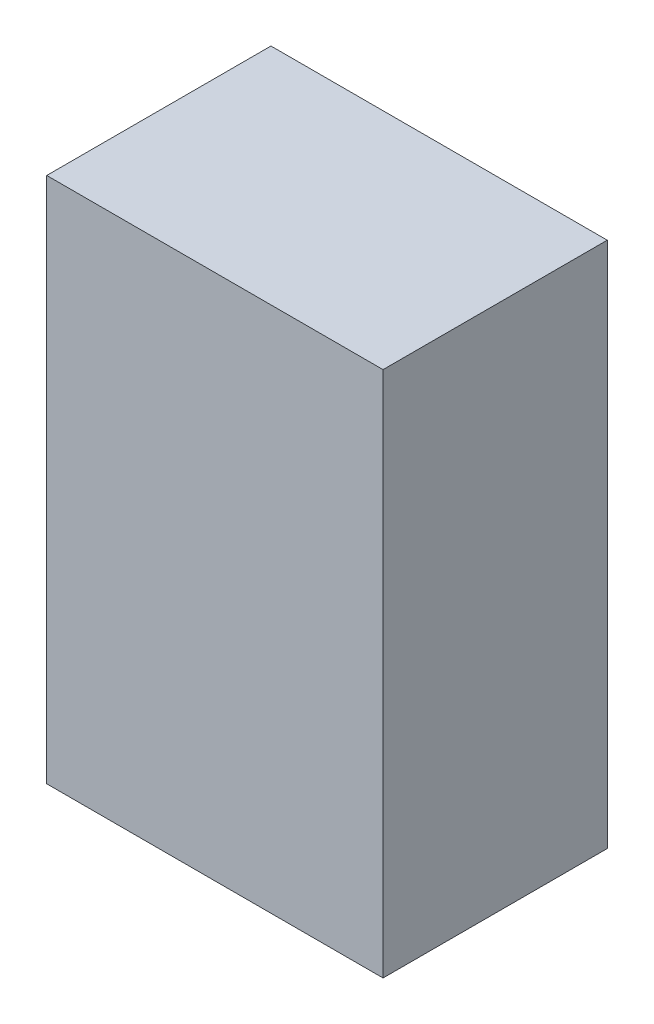
ISO-10303-21;
HEADER;
FILE_DESCRIPTION(('STEP AP214'),'2;1');
FILE_NAME('part.step','',(''),(''),'','','');
FILE_SCHEMA(('AUTOMOTIVE_DESIGN { 1 0 10303 214 1 1 1 1 }'));
ENDSEC;
DATA;
#1=APPLICATION_CONTEXT('core data for automotive mechanical design processes');
#2=APPLICATION_PROTOCOL_DEFINITION('international standard','automotive_design',2000,#1);
#3=PRODUCT_CONTEXT('',#1,'mechanical');
#4=PRODUCT('Part','Part','',(#3));
#5=PRODUCT_RELATED_PRODUCT_CATEGORY('part','',(#4));
#6=PRODUCT_DEFINITION_FORMATION('','',#4);
#7=PRODUCT_DEFINITION_CONTEXT('part definition',#1,'design');
#8=PRODUCT_DEFINITION('design','',#6,#7);
#9=PRODUCT_DEFINITION_SHAPE('','',#8);
#10=(LENGTH_UNIT() NAMED_UNIT(*) SI_UNIT(.MILLI.,.METRE.));
#11=(NAMED_UNIT(*) PLANE_ANGLE_UNIT() SI_UNIT($,.RADIAN.));
#12=(NAMED_UNIT(*) SI_UNIT($,.STERADIAN.) SOLID_ANGLE_UNIT());
#13=UNCERTAINTY_MEASURE_WITH_UNIT(LENGTH_MEASURE(1.E-05),#10,'distance_accuracy_value','');
#14=(GEOMETRIC_REPRESENTATION_CONTEXT(3) GLOBAL_UNCERTAINTY_ASSIGNED_CONTEXT((#13)) GLOBAL_UNIT_ASSIGNED_CONTEXT((#10,
#11,#12)) REPRESENTATION_CONTEXT('',''));
#15=CARTESIAN_POINT('',(0.,0.,0.));
#16=DIRECTION('',(0.,0.,1.));
#17=DIRECTION('',(1.,0.,0.));
#18=AXIS2_PLACEMENT_3D('',#15,#16,#17);
#19=CARTESIAN_POINT('',(0.381,0.5969,0.508));
#20=DIRECTION('',(0.,0.,1.));
#21=DIRECTION('',(1.,0.,0.));
#22=AXIS2_PLACEMENT_3D('',#19,#20,#21);
#23=PLANE('',#22);
#24=DIRECTION('',(1.,0.,0.));
#25=VECTOR('',#24,1.);
#26=CARTESIAN_POINT('',(0.381,-0.59689746,0.508));
#27=LINE('',#26,#25);
#28=CARTESIAN_POINT('',(0.381,-0.59689746,0.508));
#29=VERTEX_POINT('',#28);
#30=CARTESIAN_POINT('',(-0.381,-0.59689746,0.508));
#31=VERTEX_POINT('',#30);
#32=EDGE_CURVE('E53',#29,#31,#27,.F.);
#33=ORIENTED_EDGE('',*,*,#32,.F.);
#34=DIRECTION('',(0.,1.,0.));
#35=VECTOR('',#34,1.);
#36=CARTESIAN_POINT('',(0.381,0.5969,0.508));
#37=LINE('',#36,#35);
#38=CARTESIAN_POINT('',(0.381,0.5969,0.508));
#39=VERTEX_POINT('',#38);
#40=EDGE_CURVE('E68',#39,#29,#37,.F.);
#41=ORIENTED_EDGE('',*,*,#40,.F.);
#42=DIRECTION('',(1.,0.,0.));
#43=VECTOR('',#42,1.);
#44=CARTESIAN_POINT('',(-0.381,0.5969,0.508));
#45=LINE('',#44,#43);
#46=CARTESIAN_POINT('',(-0.381,0.5969,0.508));
#47=VERTEX_POINT('',#46);
#48=EDGE_CURVE('E20',#47,#39,#45,.T.);
#49=ORIENTED_EDGE('',*,*,#48,.F.);
#50=DIRECTION('',(0.,1.,0.));
#51=VECTOR('',#50,1.);
#52=CARTESIAN_POINT('',(-0.381,-0.59689746,0.508));
#53=LINE('',#52,#51);
#54=EDGE_CURVE('E58',#31,#47,#53,.T.);
#55=ORIENTED_EDGE('',*,*,#54,.F.);
#56=EDGE_LOOP('',(#33,#41,#49,#55));
#57=FACE_BOUND('',#56,.T.);
#58=ADVANCED_FACE('F17',(#57),#23,.T.);
#59=CARTESIAN_POINT('',(-0.381,0.5969,0.));
#60=DIRECTION('',(0.,1.,0.));
#61=DIRECTION('',(0.,0.,1.));
#62=AXIS2_PLACEMENT_3D('',#59,#60,#61);
#63=PLANE('',#62);
#64=DIRECTION('',(0.,0.,-1.));
#65=VECTOR('',#64,1.);
#66=CARTESIAN_POINT('',(0.381,0.5969,0.));
#67=LINE('',#66,#65);
#68=CARTESIAN_POINT('',(0.381,0.5969,0.));
#69=VERTEX_POINT('',#68);
#70=EDGE_CURVE('E79',#69,#39,#67,.F.);
#71=ORIENTED_EDGE('',*,*,#70,.F.);
#72=DIRECTION('',(1.,0.,0.));
#73=VECTOR('',#72,1.);
#74=CARTESIAN_POINT('',(0.381,0.5969,0.));
#75=LINE('',#74,#73);
#76=CARTESIAN_POINT('',(-0.381,0.5969,0.));
#77=VERTEX_POINT('',#76);
#78=EDGE_CURVE('E74',#69,#77,#75,.F.);
#79=ORIENTED_EDGE('',*,*,#78,.T.);
#80=DIRECTION('',(0.,0.,1.));
#81=VECTOR('',#80,1.);
#82=CARTESIAN_POINT('',(-0.381,0.5969,0.));
#83=LINE('',#82,#81);
#84=EDGE_CURVE('E63',#47,#77,#83,.F.);
#85=ORIENTED_EDGE('',*,*,#84,.F.);
#86=ORIENTED_EDGE('',*,*,#48,.T.);
#87=EDGE_LOOP('',(#71,#79,#85,#86));
#88=FACE_BOUND('',#87,.T.);
#89=ADVANCED_FACE('F73',(#88),#63,.T.);
#90=CARTESIAN_POINT('',(-0.381,-0.59689746,0.));
#91=DIRECTION('',(-1.,0.,0.));
#92=DIRECTION('',(0.,0.,1.));
#93=AXIS2_PLACEMENT_3D('',#90,#91,#92);
#94=PLANE('',#93);
#95=ORIENTED_EDGE('',*,*,#84,.T.);
#96=DIRECTION('',(0.,1.,0.));
#97=VECTOR('',#96,1.);
#98=CARTESIAN_POINT('',(-0.381,0.5969,0.));
#99=LINE('',#98,#97);
#100=CARTESIAN_POINT('',(-0.381,-0.59689746,0.));
#101=VERTEX_POINT('',#100);
#102=EDGE_CURVE('E84',#77,#101,#99,.F.);
#103=ORIENTED_EDGE('',*,*,#102,.T.);
#104=DIRECTION('',(0.,0.,-1.));
#105=VECTOR('',#104,1.);
#106=CARTESIAN_POINT('',(-0.381,-0.59689746,0.));
#107=LINE('',#106,#105);
#108=EDGE_CURVE('E65',#31,#101,#107,.T.);
#109=ORIENTED_EDGE('',*,*,#108,.F.);
#110=ORIENTED_EDGE('',*,*,#54,.T.);
#111=EDGE_LOOP('',(#95,#103,#109,#110));
#112=FACE_BOUND('',#111,.T.);
#113=ADVANCED_FACE('F60',(#112),#94,.T.);
#114=CARTESIAN_POINT('',(0.381,-0.59689746,0.));
#115=DIRECTION('',(0.,-1.,0.));
#116=DIRECTION('',(0.,0.,-1.));
#117=AXIS2_PLACEMENT_3D('',#114,#115,#116);
#118=PLANE('',#117);
#119=ORIENTED_EDGE('',*,*,#108,.T.);
#120=DIRECTION('',(1.,0.,0.));
#121=VECTOR('',#120,1.);
#122=CARTESIAN_POINT('',(0.381,-0.59689746,0.));
#123=LINE('',#122,#121);
#124=CARTESIAN_POINT('',(0.381,-0.59689746,0.));
#125=VERTEX_POINT('',#124);
#126=EDGE_CURVE('E26',#101,#125,#123,.T.);
#127=ORIENTED_EDGE('',*,*,#126,.T.);
#128=DIRECTION('',(0.,0.,-1.));
#129=VECTOR('',#128,1.);
#130=CARTESIAN_POINT('',(0.381,-0.59689746,0.));
#131=LINE('',#130,#129);
#132=EDGE_CURVE('E34',#29,#125,#131,.T.);
#133=ORIENTED_EDGE('',*,*,#132,.F.);
#134=ORIENTED_EDGE('',*,*,#32,.T.);
#135=EDGE_LOOP('',(#119,#127,#133,#134));
#136=FACE_BOUND('',#135,.T.);
#137=ADVANCED_FACE('F88',(#136),#118,.T.);
#138=CARTESIAN_POINT('',(0.381,0.5969,0.));
#139=DIRECTION('',(1.,0.,0.));
#140=DIRECTION('',(0.,0.,-1.));
#141=AXIS2_PLACEMENT_3D('',#138,#139,#140);
#142=PLANE('',#141);
#143=ORIENTED_EDGE('',*,*,#132,.T.);
#144=DIRECTION('',(0.,1.,0.));
#145=VECTOR('',#144,1.);
#146=CARTESIAN_POINT('',(0.381,0.5969,0.));
#147=LINE('',#146,#145);
#148=EDGE_CURVE('E11',#125,#69,#147,.T.);
#149=ORIENTED_EDGE('',*,*,#148,.T.);
#150=ORIENTED_EDGE('',*,*,#70,.T.);
#151=ORIENTED_EDGE('',*,*,#40,.T.);
#152=EDGE_LOOP('',(#143,#149,#150,#151));
#153=FACE_BOUND('',#152,.T.);
#154=ADVANCED_FACE('F91',(#153),#142,.T.);
#155=CARTESIAN_POINT('',(0.381,0.5969,0.));
#156=DIRECTION('',(0.,0.,1.));
#157=DIRECTION('',(1.,0.,0.));
#158=AXIS2_PLACEMENT_3D('',#155,#156,#157);
#159=PLANE('',#158);
#160=ORIENTED_EDGE('',*,*,#126,.F.);
#161=ORIENTED_EDGE('',*,*,#102,.F.);
#162=ORIENTED_EDGE('',*,*,#78,.F.);
#163=ORIENTED_EDGE('',*,*,#148,.F.);
#164=EDGE_LOOP('',(#160,#161,#162,#163));
#165=FACE_BOUND('',#164,.T.);
#166=ADVANCED_FACE('F90',(#165),#159,.F.);
#167=CLOSED_SHELL('',(#58,#89,#113,#137,#154,#166));
#168=MANIFOLD_SOLID_BREP('B1',#167);
#169=ADVANCED_BREP_SHAPE_REPRESENTATION('',(#18,#168),#14);
#170=SHAPE_DEFINITION_REPRESENTATION(#9,#169);
ENDSEC;
END-ISO-10303-21;
